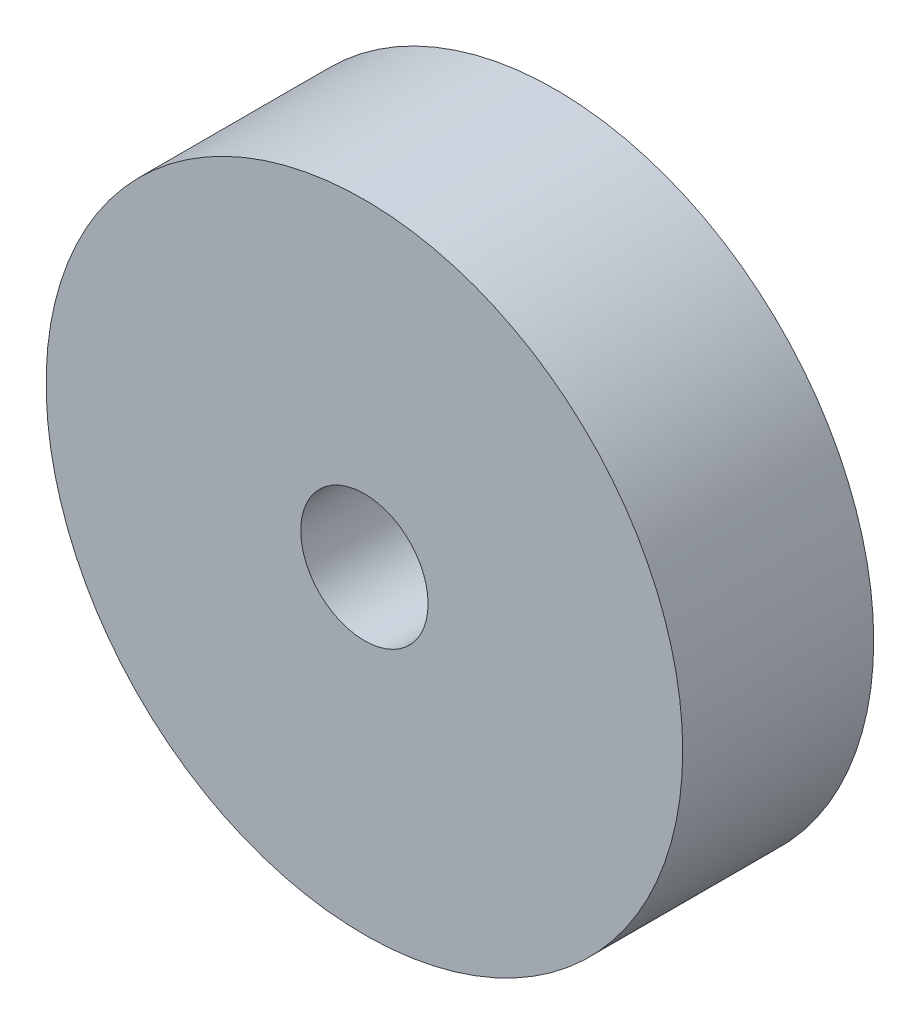
ISO-10303-21;
HEADER;
FILE_DESCRIPTION(('STEP AP214'),'2;1');
FILE_NAME('part.step','',(''),(''),'','','');
FILE_SCHEMA(('AUTOMOTIVE_DESIGN { 1 0 10303 214 1 1 1 1 }'));
ENDSEC;
DATA;
#1=APPLICATION_CONTEXT('core data for automotive mechanical design processes');
#2=APPLICATION_PROTOCOL_DEFINITION('international standard','automotive_design',2000,#1);
#3=PRODUCT_CONTEXT('',#1,'mechanical');
#4=PRODUCT('Part','Part','',(#3));
#5=PRODUCT_RELATED_PRODUCT_CATEGORY('part','',(#4));
#6=PRODUCT_DEFINITION_FORMATION('','',#4);
#7=PRODUCT_DEFINITION_CONTEXT('part definition',#1,'design');
#8=PRODUCT_DEFINITION('design','',#6,#7);
#9=PRODUCT_DEFINITION_SHAPE('','',#8);
#10=(LENGTH_UNIT() NAMED_UNIT(*) SI_UNIT(.MILLI.,.METRE.));
#11=(NAMED_UNIT(*) PLANE_ANGLE_UNIT() SI_UNIT($,.RADIAN.));
#12=(NAMED_UNIT(*) SI_UNIT($,.STERADIAN.) SOLID_ANGLE_UNIT());
#13=UNCERTAINTY_MEASURE_WITH_UNIT(LENGTH_MEASURE(1.E-05),#10,'distance_accuracy_value','');
#14=(GEOMETRIC_REPRESENTATION_CONTEXT(3) GLOBAL_UNCERTAINTY_ASSIGNED_CONTEXT((#13)) GLOBAL_UNIT_ASSIGNED_CONTEXT((#10,
#11,#12)) REPRESENTATION_CONTEXT('',''));
#15=CARTESIAN_POINT('',(0.,0.,0.));
#16=DIRECTION('',(0.,0.,1.));
#17=DIRECTION('',(1.,0.,0.));
#18=AXIS2_PLACEMENT_3D('',#15,#16,#17);
#19=CARTESIAN_POINT('',(0.,0.,12.));
#20=DIRECTION('',(0.,0.,-1.));
#21=DIRECTION('',(-1.,0.,0.));
#22=AXIS2_PLACEMENT_3D('',#19,#20,#21);
#23=CYLINDRICAL_SURFACE('',#22,20.);
#24=CARTESIAN_POINT('',(0.,0.,12.));
#25=DIRECTION('',(0.,0.,1.));
#26=DIRECTION('',(1.,0.,0.));
#27=AXIS2_PLACEMENT_3D('',#24,#25,#26);
#28=CIRCLE('',#27,20.);
#29=CARTESIAN_POINT('',(20.,0.,12.));
#30=VERTEX_POINT('',#29);
#31=EDGE_CURVE('E10',#30,#30,#28,.T.);
#32=ORIENTED_EDGE('',*,*,#31,.F.);
#33=EDGE_LOOP('',(#32));
#34=FACE_BOUND('',#33,.T.);
#35=CARTESIAN_POINT('',(0.,0.,0.));
#36=DIRECTION('',(0.,0.,1.));
#37=DIRECTION('',(1.,0.,0.));
#38=AXIS2_PLACEMENT_3D('',#35,#36,#37);
#39=CIRCLE('',#38,20.);
#40=CARTESIAN_POINT('',(20.,0.,0.));
#41=VERTEX_POINT('',#40);
#42=EDGE_CURVE('E34',#41,#41,#39,.T.);
#43=ORIENTED_EDGE('',*,*,#42,.T.);
#44=EDGE_LOOP('',(#43));
#45=FACE_BOUND('',#44,.T.);
#46=ADVANCED_FACE('F31',(#34,#45),#23,.T.);
#47=CARTESIAN_POINT('',(0.,0.,12.));
#48=DIRECTION('',(0.,0.,1.));
#49=DIRECTION('',(1.,0.,0.));
#50=AXIS2_PLACEMENT_3D('',#47,#48,#49);
#51=PLANE('',#50);
#52=CARTESIAN_POINT('',(0.,0.,12.));
#53=DIRECTION('',(0.,0.,1.));
#54=DIRECTION('',(1.,0.,0.));
#55=AXIS2_PLACEMENT_3D('',#52,#53,#54);
#56=CIRCLE('',#55,4.);
#57=CARTESIAN_POINT('',(4.,0.,12.));
#58=VERTEX_POINT('',#57);
#59=EDGE_CURVE('E43',#58,#58,#56,.T.);
#60=ORIENTED_EDGE('',*,*,#59,.F.);
#61=EDGE_LOOP('',(#60));
#62=FACE_BOUND('',#61,.T.);
#63=ORIENTED_EDGE('',*,*,#31,.T.);
#64=EDGE_LOOP('',(#63));
#65=FACE_BOUND('',#64,.T.);
#66=ADVANCED_FACE('F58',(#62,#65),#51,.T.);
#67=CARTESIAN_POINT('',(0.,0.,0.));
#68=DIRECTION('',(0.,0.,1.));
#69=DIRECTION('',(1.,0.,0.));
#70=AXIS2_PLACEMENT_3D('',#67,#68,#69);
#71=PLANE('',#70);
#72=CARTESIAN_POINT('',(0.,0.,0.));
#73=DIRECTION('',(0.,0.,1.));
#74=DIRECTION('',(1.,0.,0.));
#75=AXIS2_PLACEMENT_3D('',#72,#73,#74);
#76=CIRCLE('',#75,4.);
#77=CARTESIAN_POINT('',(4.,0.,0.));
#78=VERTEX_POINT('',#77);
#79=EDGE_CURVE('E41',#78,#78,#76,.T.);
#80=ORIENTED_EDGE('',*,*,#79,.T.);
#81=EDGE_LOOP('',(#80));
#82=FACE_BOUND('',#81,.T.);
#83=ORIENTED_EDGE('',*,*,#42,.F.);
#84=EDGE_LOOP('',(#83));
#85=FACE_BOUND('',#84,.T.);
#86=ADVANCED_FACE('F49',(#82,#85),#71,.F.);
#87=CARTESIAN_POINT('',(0.,0.,0.));
#88=DIRECTION('',(0.,0.,1.));
#89=DIRECTION('',(1.,0.,0.));
#90=AXIS2_PLACEMENT_3D('',#87,#88,#89);
#91=CYLINDRICAL_SURFACE('',#90,4.);
#92=ORIENTED_EDGE('',*,*,#79,.F.);
#93=EDGE_LOOP('',(#92));
#94=FACE_BOUND('',#93,.T.);
#95=ORIENTED_EDGE('',*,*,#59,.T.);
#96=EDGE_LOOP('',(#95));
#97=FACE_BOUND('',#96,.T.);
#98=ADVANCED_FACE('F52',(#94,#97),#91,.F.);
#99=CLOSED_SHELL('',(#46,#66,#86,#98));
#100=MANIFOLD_SOLID_BREP('B2',#99);
#101=ADVANCED_BREP_SHAPE_REPRESENTATION('',(#18,#100),#14);
#102=SHAPE_DEFINITION_REPRESENTATION(#9,#101);
ENDSEC;
END-ISO-10303-21;
